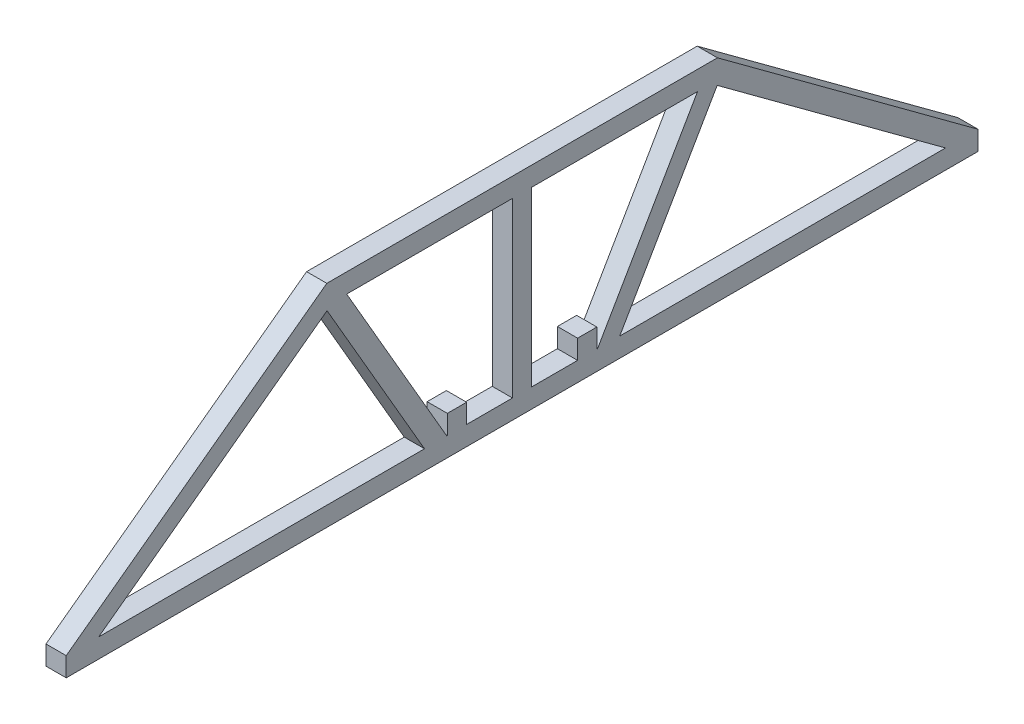
ISO-10303-21;
HEADER;
FILE_DESCRIPTION(('STEP AP214'),'2;1');
FILE_NAME('part.step','',(''),(''),'','','');
FILE_SCHEMA(('AUTOMOTIVE_DESIGN { 1 0 10303 214 1 1 1 1 }'));
ENDSEC;
DATA;
#1=APPLICATION_CONTEXT('core data for automotive mechanical design processes');
#2=APPLICATION_PROTOCOL_DEFINITION('international standard','automotive_design',2000,#1);
#3=PRODUCT_CONTEXT('',#1,'mechanical');
#4=PRODUCT('Part','Part','',(#3));
#5=PRODUCT_RELATED_PRODUCT_CATEGORY('part','',(#4));
#6=PRODUCT_DEFINITION_FORMATION('','',#4);
#7=PRODUCT_DEFINITION_CONTEXT('part definition',#1,'design');
#8=PRODUCT_DEFINITION('design','',#6,#7);
#9=PRODUCT_DEFINITION_SHAPE('','',#8);
#10=(LENGTH_UNIT() NAMED_UNIT(*) SI_UNIT(.MILLI.,.METRE.));
#11=(NAMED_UNIT(*) PLANE_ANGLE_UNIT() SI_UNIT($,.RADIAN.));
#12=(NAMED_UNIT(*) SI_UNIT($,.STERADIAN.) SOLID_ANGLE_UNIT());
#13=UNCERTAINTY_MEASURE_WITH_UNIT(LENGTH_MEASURE(1.E-05),#10,'distance_accuracy_value','');
#14=(GEOMETRIC_REPRESENTATION_CONTEXT(3) GLOBAL_UNCERTAINTY_ASSIGNED_CONTEXT((#13)) GLOBAL_UNIT_ASSIGNED_CONTEXT((#10,
#11,#12)) REPRESENTATION_CONTEXT('',''));
#15=CARTESIAN_POINT('',(0.,0.,0.));
#16=DIRECTION('',(0.,0.,1.));
#17=DIRECTION('',(1.,0.,0.));
#18=AXIS2_PLACEMENT_3D('',#15,#16,#17);
#19=CARTESIAN_POINT('',(19.525,-4.7625,268.6));
#20=DIRECTION('',(0.,-1.,0.));
#21=DIRECTION('',(0.,0.,-1.));
#22=AXIS2_PLACEMENT_3D('',#19,#20,#21);
#23=PLANE('',#22);
#24=DIRECTION('',(0.,0.,-1.));
#25=VECTOR('',#24,1.);
#26=CARTESIAN_POINT('',(19.525,-4.7625,268.6));
#27=LINE('',#26,#25);
#28=CARTESIAN_POINT('',(19.525,-4.76250000000004,3.19649980447192));
#29=VERTEX_POINT('',#28);
#30=CARTESIAN_POINT('',(19.525,-4.7625,454.003500195528));
#31=VERTEX_POINT('',#30);
#32=EDGE_CURVE('E395',#29,#31,#27,.F.);
#33=ORIENTED_EDGE('',*,*,#32,.T.);
#34=DIRECTION('',(-1.,0.,0.));
#35=VECTOR('',#34,1.);
#36=CARTESIAN_POINT('',(19.525,-4.7625,454.003500195528));
#37=LINE('',#36,#35);
#38=CARTESIAN_POINT('',(9.525,-4.7625,454.003500195528));
#39=VERTEX_POINT('',#38);
#40=EDGE_CURVE('E248',#31,#39,#37,.T.);
#41=ORIENTED_EDGE('',*,*,#40,.T.);
#42=DIRECTION('',(0.,0.,-1.));
#43=VECTOR('',#42,1.);
#44=CARTESIAN_POINT('',(9.525,-4.7625,268.6));
#45=LINE('',#44,#43);
#46=CARTESIAN_POINT('',(9.525,-4.76250000000004,3.19649980447192));
#47=VERTEX_POINT('',#46);
#48=EDGE_CURVE('E247',#47,#39,#45,.F.);
#49=ORIENTED_EDGE('',*,*,#48,.F.);
#50=DIRECTION('',(-1.,0.,0.));
#51=VECTOR('',#50,1.);
#52=CARTESIAN_POINT('',(19.525,-4.7625,3.1964998044719));
#53=LINE('',#52,#51);
#54=EDGE_CURVE('E421',#29,#47,#53,.T.);
#55=ORIENTED_EDGE('',*,*,#54,.F.);
#56=EDGE_LOOP('',(#33,#41,#49,#55));
#57=FACE_BOUND('',#56,.T.);
#58=ADVANCED_FACE('F43',(#57),#23,.T.);
#59=CARTESIAN_POINT('',(9.525,0.,0.));
#60=DIRECTION('',(-1.,0.,0.));
#61=DIRECTION('',(0.,0.,1.));
#62=AXIS2_PLACEMENT_3D('',#59,#60,#61);
#63=PLANE('',#62);
#64=DIRECTION('',(0.,0.865426285481126,-0.501036270541706));
#65=VECTOR('',#64,1.);
#66=CARTESIAN_POINT('',(9.525,-2.38618523845487,184.478407315396));
#67=LINE('',#66,#65);
#68=CARTESIAN_POINT('',(9.525,4.76250000000003,180.339694808922));
#69=VERTEX_POINT('',#68);
#70=CARTESIAN_POINT('',(9.525,88.0093147182848,132.144170498336));
#71=VERTEX_POINT('',#70);
#72=EDGE_CURVE('E333',#69,#71,#67,.T.);
#73=ORIENTED_EDGE('',*,*,#72,.F.);
#74=DIRECTION('',(0.,0.,-1.));
#75=VECTOR('',#74,1.);
#76=CARTESIAN_POINT('',(9.525,4.7625,4.7625));
#77=LINE('',#76,#75);
#78=CARTESIAN_POINT('',(9.525,4.7625,19.246154800791));
#79=VERTEX_POINT('',#78);
#80=EDGE_CURVE('E352',#79,#69,#77,.F.);
#81=ORIENTED_EDGE('',*,*,#80,.F.);
#82=DIRECTION('',(0.,-0.593470700908183,-0.804855593981647));
#83=VECTOR('',#82,1.);
#84=CARTESIAN_POINT('',(9.525,91.1668752336637,136.426404213074));
#85=LINE('',#84,#83);
#86=EDGE_CURVE('E347',#71,#79,#85,.T.);
#87=ORIENTED_EDGE('',*,*,#86,.F.);
#88=EDGE_LOOP('',(#73,#81,#87));
#89=FACE_BOUND('',#88,.T.);
#90=DIRECTION('',(0.,0.865426285481126,-0.501036270541706));
#91=VECTOR('',#90,1.);
#92=CARTESIAN_POINT('',(9.525,2.38618523845487,192.721592684604));
#93=LINE('',#92,#91);
#94=CARTESIAN_POINT('',(9.525,4.7625,191.345831506867));
#95=VERTEX_POINT('',#94);
#96=CARTESIAN_POINT('',(9.525,90.2375000000014,141.860305191077));
#97=VERTEX_POINT('',#96);
#98=EDGE_CURVE('E329',#95,#97,#93,.T.);
#99=ORIENTED_EDGE('',*,*,#98,.T.);
#100=DIRECTION('',(0.,0.,-1.));
#101=VECTOR('',#100,1.);
#102=CARTESIAN_POINT('',(9.525,90.2375000000021,228.599999999999));
#103=LINE('',#102,#101);
#104=CARTESIAN_POINT('',(9.525,90.2375000000021,223.837499999999));
#105=VERTEX_POINT('',#104);
#106=EDGE_CURVE('E340',#105,#97,#103,.T.);
#107=ORIENTED_EDGE('',*,*,#106,.F.);
#108=DIRECTION('',(0.,1.,0.));
#109=VECTOR('',#108,1.);
#110=CARTESIAN_POINT('',(9.525,0.,223.8375));
#111=LINE('',#110,#109);
#112=CARTESIAN_POINT('',(9.525,4.7625,223.8375));
#113=VERTEX_POINT('',#112);
#114=EDGE_CURVE('E311',#113,#105,#111,.T.);
#115=ORIENTED_EDGE('',*,*,#114,.F.);
#116=DIRECTION('',(0.,0.,-1.));
#117=VECTOR('',#116,1.);
#118=CARTESIAN_POINT('',(9.525,4.7625,188.6));
#119=LINE('',#118,#117);
#120=CARTESIAN_POINT('',(9.525,4.7625,201.159706485816));
#121=VERTEX_POINT('',#120);
#122=EDGE_CURVE('E324',#121,#113,#119,.F.);
#123=ORIENTED_EDGE('',*,*,#122,.F.);
#124=DIRECTION('',(0.,-1.,0.));
#125=VECTOR('',#124,1.);
#126=CARTESIAN_POINT('',(9.525,0.,201.159706485816));
#127=LINE('',#126,#125);
#128=CARTESIAN_POINT('',(9.525,14.2875,201.159706485816));
#129=VERTEX_POINT('',#128);
#130=EDGE_CURVE('E58',#129,#121,#127,.T.);
#131=ORIENTED_EDGE('',*,*,#130,.F.);
#132=DIRECTION('',(0.,0.,1.));
#133=VECTOR('',#132,1.);
#134=CARTESIAN_POINT('',(9.525,14.2875,0.));
#135=LINE('',#134,#133);
#136=CARTESIAN_POINT('',(9.525,14.2875,191.634706485816));
#137=VERTEX_POINT('',#136);
#138=EDGE_CURVE('E445',#137,#129,#135,.T.);
#139=ORIENTED_EDGE('',*,*,#138,.F.);
#140=DIRECTION('',(0.,1.,0.));
#141=VECTOR('',#140,1.);
#142=CARTESIAN_POINT('',(9.525,0.,191.634706485816));
#143=LINE('',#142,#141);
#144=CARTESIAN_POINT('',(9.525,4.7625,191.634706485816));
#145=VERTEX_POINT('',#144);
#146=EDGE_CURVE('E436',#145,#137,#143,.T.);
#147=ORIENTED_EDGE('',*,*,#146,.F.);
#148=EDGE_CURVE('E321',#95,#145,#119,.F.);
#149=ORIENTED_EDGE('',*,*,#148,.F.);
#150=EDGE_LOOP('',(#99,#107,#115,#123,#131,#139,#147,#149));
#151=FACE_BOUND('',#150,.T.);
#152=DIRECTION('',(0.,0.,-1.));
#153=VECTOR('',#152,1.);
#154=CARTESIAN_POINT('',(9.525,4.7625,228.6));
#155=LINE('',#154,#153);
#156=CARTESIAN_POINT('',(9.525,4.7625,233.3625));
#157=VERTEX_POINT('',#156);
#158=CARTESIAN_POINT('',(9.525,4.7625,256.040293514184));
#159=VERTEX_POINT('',#158);
#160=EDGE_CURVE('E299',#157,#159,#155,.F.);
#161=ORIENTED_EDGE('',*,*,#160,.F.);
#162=DIRECTION('',(0.,1.,0.));
#163=VECTOR('',#162,1.);
#164=CARTESIAN_POINT('',(9.525,0.,233.3625));
#165=LINE('',#164,#163);
#166=CARTESIAN_POINT('',(9.525,90.2375000000022,233.362499999999));
#167=VERTEX_POINT('',#166);
#168=EDGE_CURVE('E307',#157,#167,#165,.T.);
#169=ORIENTED_EDGE('',*,*,#168,.T.);
#170=DIRECTION('',(0.,0.,-1.));
#171=VECTOR('',#170,1.);
#172=CARTESIAN_POINT('',(9.525,90.237500000003,323.599999999999));
#173=LINE('',#172,#171);
#174=CARTESIAN_POINT('',(9.525,90.2375000000029,315.339694808921));
#175=VERTEX_POINT('',#174);
#176=EDGE_CURVE('E277',#175,#167,#173,.T.);
#177=ORIENTED_EDGE('',*,*,#176,.F.);
#178=DIRECTION('',(0.,0.865426285481136,0.501036270541687));
#179=VECTOR('',#178,1.);
#180=CARTESIAN_POINT('',(9.525,2.38618523845479,264.478407315396));
#181=LINE('',#180,#179);
#182=CARTESIAN_POINT('',(9.525,4.7625,265.854168493133));
#183=VERTEX_POINT('',#182);
#184=EDGE_CURVE('E289',#183,#175,#181,.T.);
#185=ORIENTED_EDGE('',*,*,#184,.F.);
#186=CARTESIAN_POINT('',(9.525,4.7625,265.565293514184));
#187=VERTEX_POINT('',#186);
#188=EDGE_CURVE('E302',#187,#183,#155,.F.);
#189=ORIENTED_EDGE('',*,*,#188,.F.);
#190=DIRECTION('',(0.,-1.,0.));
#191=VECTOR('',#190,1.);
#192=CARTESIAN_POINT('',(9.525,0.,265.565293514184));
#193=LINE('',#192,#191);
#194=CARTESIAN_POINT('',(9.525,14.2875,265.565293514184));
#195=VERTEX_POINT('',#194);
#196=EDGE_CURVE('E66',#195,#187,#193,.T.);
#197=ORIENTED_EDGE('',*,*,#196,.F.);
#198=DIRECTION('',(0.,0.,1.));
#199=VECTOR('',#198,1.);
#200=CARTESIAN_POINT('',(9.525,14.2875,0.));
#201=LINE('',#200,#199);
#202=CARTESIAN_POINT('',(9.525,14.2875,256.040293514184));
#203=VERTEX_POINT('',#202);
#204=EDGE_CURVE('E470',#203,#195,#201,.T.);
#205=ORIENTED_EDGE('',*,*,#204,.F.);
#206=DIRECTION('',(0.,1.,0.));
#207=VECTOR('',#206,1.);
#208=CARTESIAN_POINT('',(9.525,0.,256.040293514184));
#209=LINE('',#208,#207);
#210=EDGE_CURVE('E458',#159,#203,#209,.T.);
#211=ORIENTED_EDGE('',*,*,#210,.F.);
#212=EDGE_LOOP('',(#161,#169,#177,#185,#189,#197,#205,#211));
#213=FACE_BOUND('',#212,.T.);
#214=DIRECTION('',(0.,0.865426285481136,0.501036270541687));
#215=VECTOR('',#214,1.);
#216=CARTESIAN_POINT('',(9.525,-2.38618523845479,272.721592684604));
#217=LINE('',#216,#215);
#218=CARTESIAN_POINT('',(9.525,4.7625,276.860305191078));
#219=VERTEX_POINT('',#218);
#220=CARTESIAN_POINT('',(9.525,88.0093147182864,325.055829501662));
#221=VERTEX_POINT('',#220);
#222=EDGE_CURVE('E286',#219,#221,#217,.T.);
#223=ORIENTED_EDGE('',*,*,#222,.T.);
#224=DIRECTION('',(0.,0.593470700908185,-0.804855593981646));
#225=VECTOR('',#224,1.);
#226=CARTESIAN_POINT('',(9.525,-3.83312476633759,449.611095786925));
#227=LINE('',#226,#225);
#228=CARTESIAN_POINT('',(9.525,4.7625,437.953845199209));
#229=VERTEX_POINT('',#228);
#230=EDGE_CURVE('E254',#229,#221,#227,.T.);
#231=ORIENTED_EDGE('',*,*,#230,.F.);
#232=DIRECTION('',(0.,0.,-1.));
#233=VECTOR('',#232,1.);
#234=CARTESIAN_POINT('',(9.525,4.7625,268.6));
#235=LINE('',#234,#233);
#236=EDGE_CURVE('E256',#219,#229,#235,.F.);
#237=ORIENTED_EDGE('',*,*,#236,.F.);
#238=EDGE_LOOP('',(#223,#231,#237));
#239=FACE_BOUND('',#238,.T.);
#240=ORIENTED_EDGE('',*,*,#48,.T.);
#241=DIRECTION('',(0.,1.,0.));
#242=VECTOR('',#241,1.);
#243=CARTESIAN_POINT('',(9.525,0.,454.003500195528));
#244=LINE('',#243,#242);
#245=CARTESIAN_POINT('',(9.525,4.7625,454.003500195528));
#246=VERTEX_POINT('',#245);
#247=EDGE_CURVE('E229',#39,#246,#244,.T.);
#248=ORIENTED_EDGE('',*,*,#247,.T.);
#249=DIRECTION('',(0.,0.593470700908185,-0.804855593981646));
#250=VECTOR('',#249,1.);
#251=CARTESIAN_POINT('',(9.525,3.83312476633759,455.263904213075));
#252=LINE('',#251,#250);
#253=CARTESIAN_POINT('',(9.525,99.762500000003,325.166000195527));
#254=VERTEX_POINT('',#253);
#255=EDGE_CURVE('E243',#246,#254,#252,.T.);
#256=ORIENTED_EDGE('',*,*,#255,.T.);
#257=DIRECTION('',(0.,0.,-1.));
#258=VECTOR('',#257,1.);
#259=CARTESIAN_POINT('',(9.525,99.762500000003,323.599999999999));
#260=LINE('',#259,#258);
#261=CARTESIAN_POINT('',(9.525,99.762500000003,132.033999804473));
#262=VERTEX_POINT('',#261);
#263=EDGE_CURVE('E273',#254,#262,#260,.T.);
#264=ORIENTED_EDGE('',*,*,#263,.T.);
#265=DIRECTION('',(0.,-0.593470700908183,-0.804855593981647));
#266=VECTOR('',#265,1.);
#267=CARTESIAN_POINT('',(9.525,98.8331247663389,130.773595786924));
#268=LINE('',#267,#266);
#269=CARTESIAN_POINT('',(9.525,4.7625,3.19649980447192));
#270=VERTEX_POINT('',#269);
#271=EDGE_CURVE('E355',#262,#270,#268,.T.);
#272=ORIENTED_EDGE('',*,*,#271,.T.);
#273=DIRECTION('',(0.,1.,0.));
#274=VECTOR('',#273,1.);
#275=CARTESIAN_POINT('',(9.525,0.,3.19649980447192));
#276=LINE('',#275,#274);
#277=EDGE_CURVE('E424',#47,#270,#276,.T.);
#278=ORIENTED_EDGE('',*,*,#277,.F.);
#279=EDGE_LOOP('',(#240,#248,#256,#264,#272,#278));
#280=FACE_BOUND('',#279,.T.);
#281=ADVANCED_FACE('F241',(#89,#151,#213,#239,#280),#63,.T.);
#282=CARTESIAN_POINT('',(19.525,0.,0.));
#283=DIRECTION('',(-1.,0.,0.));
#284=DIRECTION('',(0.,0.,1.));
#285=AXIS2_PLACEMENT_3D('',#282,#283,#284);
#286=PLANE('',#285);
#287=DIRECTION('',(0.,0.593470700908185,-0.804855593981646));
#288=VECTOR('',#287,1.);
#289=CARTESIAN_POINT('',(19.525,-3.83312476633759,449.611095786925));
#290=LINE('',#289,#288);
#291=CARTESIAN_POINT('',(19.525,4.7625,437.953845199209));
#292=VERTEX_POINT('',#291);
#293=CARTESIAN_POINT('',(19.525,88.0093147182864,325.055829501662));
#294=VERTEX_POINT('',#293);
#295=EDGE_CURVE('E264',#292,#294,#290,.T.);
#296=ORIENTED_EDGE('',*,*,#295,.T.);
#297=DIRECTION('',(0.,0.865426285481136,0.501036270541687));
#298=VECTOR('',#297,1.);
#299=CARTESIAN_POINT('',(19.525,-2.38618523845479,272.721592684604));
#300=LINE('',#299,#298);
#301=CARTESIAN_POINT('',(19.525,4.7625,276.860305191078));
#302=VERTEX_POINT('',#301);
#303=EDGE_CURVE('E285',#302,#294,#300,.T.);
#304=ORIENTED_EDGE('',*,*,#303,.F.);
#305=DIRECTION('',(0.,0.,-1.));
#306=VECTOR('',#305,1.);
#307=CARTESIAN_POINT('',(19.525,4.7625,268.6));
#308=LINE('',#307,#306);
#309=EDGE_CURVE('E268',#302,#292,#308,.F.);
#310=ORIENTED_EDGE('',*,*,#309,.T.);
#311=EDGE_LOOP('',(#296,#304,#310));
#312=FACE_BOUND('',#311,.T.);
#313=DIRECTION('',(0.,1.,0.));
#314=VECTOR('',#313,1.);
#315=CARTESIAN_POINT('',(19.525,0.,233.3625));
#316=LINE('',#315,#314);
#317=CARTESIAN_POINT('',(19.525,4.7625,233.3625));
#318=VERTEX_POINT('',#317);
#319=CARTESIAN_POINT('',(19.525,90.2375000000022,233.362499999999));
#320=VERTEX_POINT('',#319);
#321=EDGE_CURVE('E306',#318,#320,#316,.T.);
#322=ORIENTED_EDGE('',*,*,#321,.F.);
#323=DIRECTION('',(0.,0.,-1.));
#324=VECTOR('',#323,1.);
#325=CARTESIAN_POINT('',(19.525,4.7625,228.6));
#326=LINE('',#325,#324);
#327=CARTESIAN_POINT('',(19.525,4.7625,256.040293514184));
#328=VERTEX_POINT('',#327);
#329=EDGE_CURVE('E295',#318,#328,#326,.F.);
#330=ORIENTED_EDGE('',*,*,#329,.T.);
#331=DIRECTION('',(0.,1.,0.));
#332=VECTOR('',#331,1.);
#333=CARTESIAN_POINT('',(19.525,0.,256.040293514184));
#334=LINE('',#333,#332);
#335=CARTESIAN_POINT('',(19.525,14.2875,256.040293514184));
#336=VERTEX_POINT('',#335);
#337=EDGE_CURVE('E454',#328,#336,#334,.T.);
#338=ORIENTED_EDGE('',*,*,#337,.T.);
#339=DIRECTION('',(0.,0.,1.));
#340=VECTOR('',#339,1.);
#341=CARTESIAN_POINT('',(19.525,14.2875,0.));
#342=LINE('',#341,#340);
#343=CARTESIAN_POINT('',(19.525,14.2875,265.565293514184));
#344=VERTEX_POINT('',#343);
#345=EDGE_CURVE('E459',#336,#344,#342,.T.);
#346=ORIENTED_EDGE('',*,*,#345,.T.);
#347=DIRECTION('',(0.,-1.,0.));
#348=VECTOR('',#347,1.);
#349=CARTESIAN_POINT('',(19.525,0.,265.565293514184));
#350=LINE('',#349,#348);
#351=CARTESIAN_POINT('',(19.525,4.7625,265.565293514184));
#352=VERTEX_POINT('',#351);
#353=EDGE_CURVE('E455',#344,#352,#350,.T.);
#354=ORIENTED_EDGE('',*,*,#353,.T.);
#355=CARTESIAN_POINT('',(19.525,4.7625,265.854168493133));
#356=VERTEX_POINT('',#355);
#357=EDGE_CURVE('E298',#352,#356,#326,.F.);
#358=ORIENTED_EDGE('',*,*,#357,.T.);
#359=DIRECTION('',(0.,0.865426285481136,0.501036270541687));
#360=VECTOR('',#359,1.);
#361=CARTESIAN_POINT('',(19.525,2.38618523845479,264.478407315396));
#362=LINE('',#361,#360);
#363=CARTESIAN_POINT('',(19.525,90.2375000000029,315.339694808921));
#364=VERTEX_POINT('',#363);
#365=EDGE_CURVE('E282',#356,#364,#362,.T.);
#366=ORIENTED_EDGE('',*,*,#365,.T.);
#367=DIRECTION('',(0.,0.,-1.));
#368=VECTOR('',#367,1.);
#369=CARTESIAN_POINT('',(19.525,90.237500000003,323.599999999999));
#370=LINE('',#369,#368);
#371=EDGE_CURVE('E269',#364,#320,#370,.T.);
#372=ORIENTED_EDGE('',*,*,#371,.T.);
#373=EDGE_LOOP('',(#322,#330,#338,#346,#354,#358,#366,#372));
#374=FACE_BOUND('',#373,.T.);
#375=DIRECTION('',(0.,0.,-1.));
#376=VECTOR('',#375,1.);
#377=CARTESIAN_POINT('',(19.525,90.2375000000021,228.599999999999));
#378=LINE('',#377,#376);
#379=CARTESIAN_POINT('',(19.525,90.2375000000021,223.837499999999));
#380=VERTEX_POINT('',#379);
#381=CARTESIAN_POINT('',(19.525,90.2375000000014,141.860305191077));
#382=VERTEX_POINT('',#381);
#383=EDGE_CURVE('E336',#380,#382,#378,.T.);
#384=ORIENTED_EDGE('',*,*,#383,.T.);
#385=DIRECTION('',(0.,0.865426285481126,-0.501036270541706));
#386=VECTOR('',#385,1.);
#387=CARTESIAN_POINT('',(19.525,2.38618523845487,192.721592684604));
#388=LINE('',#387,#386);
#389=CARTESIAN_POINT('',(19.525,4.7625,191.345831506867));
#390=VERTEX_POINT('',#389);
#391=EDGE_CURVE('E328',#390,#382,#388,.T.);
#392=ORIENTED_EDGE('',*,*,#391,.F.);
#393=DIRECTION('',(0.,0.,-1.));
#394=VECTOR('',#393,1.);
#395=CARTESIAN_POINT('',(19.525,4.7625,188.6));
#396=LINE('',#395,#394);
#397=CARTESIAN_POINT('',(19.525,4.7625,191.634706485816));
#398=VERTEX_POINT('',#397);
#399=EDGE_CURVE('E317',#390,#398,#396,.F.);
#400=ORIENTED_EDGE('',*,*,#399,.T.);
#401=DIRECTION('',(0.,1.,0.));
#402=VECTOR('',#401,1.);
#403=CARTESIAN_POINT('',(19.525,0.,191.634706485816));
#404=LINE('',#403,#402);
#405=CARTESIAN_POINT('',(19.525,14.2875,191.634706485816));
#406=VERTEX_POINT('',#405);
#407=EDGE_CURVE('E423',#398,#406,#404,.T.);
#408=ORIENTED_EDGE('',*,*,#407,.T.);
#409=DIRECTION('',(0.,0.,1.));
#410=VECTOR('',#409,1.);
#411=CARTESIAN_POINT('',(19.525,14.2875,0.));
#412=LINE('',#411,#410);
#413=CARTESIAN_POINT('',(19.525,14.2875,201.159706485816));
#414=VERTEX_POINT('',#413);
#415=EDGE_CURVE('E427',#406,#414,#412,.T.);
#416=ORIENTED_EDGE('',*,*,#415,.T.);
#417=DIRECTION('',(0.,-1.,0.));
#418=VECTOR('',#417,1.);
#419=CARTESIAN_POINT('',(19.525,0.,201.159706485816));
#420=LINE('',#419,#418);
#421=CARTESIAN_POINT('',(19.525,4.7625,201.159706485816));
#422=VERTEX_POINT('',#421);
#423=EDGE_CURVE('E433',#414,#422,#420,.T.);
#424=ORIENTED_EDGE('',*,*,#423,.T.);
#425=CARTESIAN_POINT('',(19.525,4.7625,223.8375));
#426=VERTEX_POINT('',#425);
#427=EDGE_CURVE('E320',#422,#426,#396,.F.);
#428=ORIENTED_EDGE('',*,*,#427,.T.);
#429=DIRECTION('',(0.,1.,0.));
#430=VECTOR('',#429,1.);
#431=CARTESIAN_POINT('',(19.525,0.,223.8375));
#432=LINE('',#431,#430);
#433=EDGE_CURVE('E303',#426,#380,#432,.T.);
#434=ORIENTED_EDGE('',*,*,#433,.T.);
#435=EDGE_LOOP('',(#384,#392,#400,#408,#416,#424,#428,#434));
#436=FACE_BOUND('',#435,.T.);
#437=DIRECTION('',(0.,0.,-1.));
#438=VECTOR('',#437,1.);
#439=CARTESIAN_POINT('',(19.525,4.7625,4.7625));
#440=LINE('',#439,#438);
#441=CARTESIAN_POINT('',(19.525,4.7625,19.246154800791));
#442=VERTEX_POINT('',#441);
#443=CARTESIAN_POINT('',(19.525,4.76250000000003,180.339694808922));
#444=VERTEX_POINT('',#443);
#445=EDGE_CURVE('E343',#442,#444,#440,.F.);
#446=ORIENTED_EDGE('',*,*,#445,.T.);
#447=DIRECTION('',(0.,0.865426285481126,-0.501036270541706));
#448=VECTOR('',#447,1.);
#449=CARTESIAN_POINT('',(19.525,-2.38618523845487,184.478407315396));
#450=LINE('',#449,#448);
#451=CARTESIAN_POINT('',(19.525,88.0093147182848,132.144170498336));
#452=VERTEX_POINT('',#451);
#453=EDGE_CURVE('E325',#444,#452,#450,.T.);
#454=ORIENTED_EDGE('',*,*,#453,.T.);
#455=DIRECTION('',(0.,-0.593470700908183,-0.804855593981647));
#456=VECTOR('',#455,1.);
#457=CARTESIAN_POINT('',(19.525,91.1668752336637,136.426404213074));
#458=LINE('',#457,#456);
#459=EDGE_CURVE('E350',#452,#442,#458,.T.);
#460=ORIENTED_EDGE('',*,*,#459,.T.);
#461=EDGE_LOOP('',(#446,#454,#460));
#462=FACE_BOUND('',#461,.T.);
#463=DIRECTION('',(0.,1.,0.));
#464=VECTOR('',#463,1.);
#465=CARTESIAN_POINT('',(19.525,0.,454.003500195528));
#466=LINE('',#465,#464);
#467=CARTESIAN_POINT('',(19.525,4.7625,454.003500195528));
#468=VERTEX_POINT('',#467);
#469=EDGE_CURVE('E232',#31,#468,#466,.T.);
#470=ORIENTED_EDGE('',*,*,#469,.F.);
#471=ORIENTED_EDGE('',*,*,#32,.F.);
#472=DIRECTION('',(0.,1.,0.));
#473=VECTOR('',#472,1.);
#474=CARTESIAN_POINT('',(19.525,0.,3.19649980447192));
#475=LINE('',#474,#473);
#476=CARTESIAN_POINT('',(19.525,4.7625,3.19649980447192));
#477=VERTEX_POINT('',#476);
#478=EDGE_CURVE('E429',#29,#477,#475,.T.);
#479=ORIENTED_EDGE('',*,*,#478,.T.);
#480=DIRECTION('',(0.,-0.593470700908183,-0.804855593981647));
#481=VECTOR('',#480,1.);
#482=CARTESIAN_POINT('',(19.525,98.8331247663389,130.773595786924));
#483=LINE('',#482,#481);
#484=CARTESIAN_POINT('',(19.525,99.762500000003,132.033999804473));
#485=VERTEX_POINT('',#484);
#486=EDGE_CURVE('E346',#485,#477,#483,.T.);
#487=ORIENTED_EDGE('',*,*,#486,.F.);
#488=DIRECTION('',(0.,0.,-1.));
#489=VECTOR('',#488,1.);
#490=CARTESIAN_POINT('',(19.525,99.762500000003,323.599999999999));
#491=LINE('',#490,#489);
#492=CARTESIAN_POINT('',(19.525,99.762500000003,325.166000195527));
#493=VERTEX_POINT('',#492);
#494=EDGE_CURVE('E272',#493,#485,#491,.T.);
#495=ORIENTED_EDGE('',*,*,#494,.F.);
#496=DIRECTION('',(0.,0.593470700908185,-0.804855593981646));
#497=VECTOR('',#496,1.);
#498=CARTESIAN_POINT('',(19.525,3.83312476633759,455.263904213075));
#499=LINE('',#498,#497);
#500=EDGE_CURVE('E393',#468,#493,#499,.T.);
#501=ORIENTED_EDGE('',*,*,#500,.F.);
#502=EDGE_LOOP('',(#470,#471,#479,#487,#495,#501));
#503=FACE_BOUND('',#502,.T.);
#504=ADVANCED_FACE('F401',(#312,#374,#436,#462,#503),#286,.F.);
#505=CARTESIAN_POINT('',(19.525,4.7625,188.6));
#506=DIRECTION('',(0.,-1.,0.));
#507=DIRECTION('',(0.,0.,-1.));
#508=AXIS2_PLACEMENT_3D('',#505,#506,#507);
#509=PLANE('',#508);
#510=ORIENTED_EDGE('',*,*,#148,.T.);
#511=DIRECTION('',(1.,0.,0.));
#512=VECTOR('',#511,1.);
#513=CARTESIAN_POINT('',(-6.52465499631914,4.7625,191.634706485816));
#514=LINE('',#513,#512);
#515=EDGE_CURVE('E449',#145,#398,#514,.T.);
#516=ORIENTED_EDGE('',*,*,#515,.T.);
#517=ORIENTED_EDGE('',*,*,#399,.F.);
#518=DIRECTION('',(-1.,0.,0.));
#519=VECTOR('',#518,1.);
#520=CARTESIAN_POINT('',(19.525,4.7625,191.345831506867));
#521=LINE('',#520,#519);
#522=EDGE_CURVE('E314',#390,#95,#521,.T.);
#523=ORIENTED_EDGE('',*,*,#522,.T.);
#524=EDGE_LOOP('',(#510,#516,#517,#523));
#525=FACE_BOUND('',#524,.T.);
#526=ADVANCED_FACE('F404',(#525),#509,.F.);
#527=CARTESIAN_POINT('',(19.525,4.7625,228.6));
#528=DIRECTION('',(0.,-1.,0.));
#529=DIRECTION('',(0.,0.,-1.));
#530=AXIS2_PLACEMENT_3D('',#527,#528,#529);
#531=PLANE('',#530);
#532=ORIENTED_EDGE('',*,*,#160,.T.);
#533=DIRECTION('',(1.,0.,0.));
#534=VECTOR('',#533,1.);
#535=CARTESIAN_POINT('',(-6.52465499631914,4.7625,256.040293514184));
#536=LINE('',#535,#534);
#537=EDGE_CURVE('E237',#159,#328,#536,.T.);
#538=ORIENTED_EDGE('',*,*,#537,.T.);
#539=ORIENTED_EDGE('',*,*,#329,.F.);
#540=DIRECTION('',(-1.,0.,0.));
#541=VECTOR('',#540,1.);
#542=CARTESIAN_POINT('',(19.525,4.7625,233.3625));
#543=LINE('',#542,#541);
#544=EDGE_CURVE('E292',#318,#157,#543,.T.);
#545=ORIENTED_EDGE('',*,*,#544,.T.);
#546=EDGE_LOOP('',(#532,#538,#539,#545));
#547=FACE_BOUND('',#546,.T.);
#548=ADVANCED_FACE('F529',(#547),#531,.F.);
#549=CARTESIAN_POINT('',(19.525,98.8331247663389,130.773595786924));
#550=DIRECTION('',(0.,0.804855593981647,-0.593470700908183));
#551=DIRECTION('',(0.,0.593470700908183,0.804855593981647));
#552=AXIS2_PLACEMENT_3D('',#549,#550,#551);
#553=PLANE('',#552);
#554=ORIENTED_EDGE('',*,*,#486,.T.);
#555=DIRECTION('',(1.,0.,0.));
#556=VECTOR('',#555,1.);
#557=CARTESIAN_POINT('',(-6.52465499631914,4.7625,3.19649980447192));
#558=LINE('',#557,#556);
#559=EDGE_CURVE('E236',#270,#477,#558,.T.);
#560=ORIENTED_EDGE('',*,*,#559,.F.);
#561=ORIENTED_EDGE('',*,*,#271,.F.);
#562=DIRECTION('',(1.,0.,0.));
#563=VECTOR('',#562,1.);
#564=CARTESIAN_POINT('',(-6.52465499631914,99.762500000003,132.033999804473));
#565=LINE('',#564,#563);
#566=EDGE_CURVE('E356',#262,#485,#565,.T.);
#567=ORIENTED_EDGE('',*,*,#566,.T.);
#568=EDGE_LOOP('',(#554,#560,#561,#567));
#569=FACE_BOUND('',#568,.T.);
#570=ADVANCED_FACE('F482',(#569),#553,.T.);
#571=CARTESIAN_POINT('',(19.525,4.7625,268.6));
#572=DIRECTION('',(0.,-1.,0.));
#573=DIRECTION('',(0.,0.,-1.));
#574=AXIS2_PLACEMENT_3D('',#571,#572,#573);
#575=PLANE('',#574);
#576=ORIENTED_EDGE('',*,*,#309,.F.);
#577=DIRECTION('',(-1.,0.,0.));
#578=VECTOR('',#577,1.);
#579=CARTESIAN_POINT('',(19.525,4.7625,276.860305191078));
#580=LINE('',#579,#578);
#581=EDGE_CURVE('E51',#302,#219,#580,.T.);
#582=ORIENTED_EDGE('',*,*,#581,.T.);
#583=ORIENTED_EDGE('',*,*,#236,.T.);
#584=DIRECTION('',(-1.,0.,0.));
#585=VECTOR('',#584,1.);
#586=CARTESIAN_POINT('',(19.525,4.7625,437.953845199209));
#587=LINE('',#586,#585);
#588=EDGE_CURVE('E265',#292,#229,#587,.T.);
#589=ORIENTED_EDGE('',*,*,#588,.F.);
#590=EDGE_LOOP('',(#576,#582,#583,#589));
#591=FACE_BOUND('',#590,.T.);
#592=ADVANCED_FACE('F380',(#591),#575,.F.);
#593=CARTESIAN_POINT('',(19.525,-3.83312476633759,449.611095786925));
#594=DIRECTION('',(0.,0.804855593981646,0.593470700908185));
#595=DIRECTION('',(0.,-0.593470700908185,0.804855593981646));
#596=AXIS2_PLACEMENT_3D('',#593,#594,#595);
#597=PLANE('',#596);
#598=ORIENTED_EDGE('',*,*,#230,.T.);
#599=DIRECTION('',(1.,0.,0.));
#600=VECTOR('',#599,1.);
#601=CARTESIAN_POINT('',(19.525,88.0093147182864,325.055829501662));
#602=LINE('',#601,#600);
#603=EDGE_CURVE('E11',#221,#294,#602,.T.);
#604=ORIENTED_EDGE('',*,*,#603,.T.);
#605=ORIENTED_EDGE('',*,*,#295,.F.);
#606=ORIENTED_EDGE('',*,*,#588,.T.);
#607=EDGE_LOOP('',(#598,#604,#605,#606));
#608=FACE_BOUND('',#607,.T.);
#609=ADVANCED_FACE('F389',(#608),#597,.F.);
#610=CARTESIAN_POINT('',(19.525,3.83312476633759,455.263904213075));
#611=DIRECTION('',(0.,0.804855593981646,0.593470700908185));
#612=DIRECTION('',(0.,-0.593470700908185,0.804855593981646));
#613=AXIS2_PLACEMENT_3D('',#610,#611,#612);
#614=PLANE('',#613);
#615=DIRECTION('',(1.,0.,0.));
#616=VECTOR('',#615,1.);
#617=CARTESIAN_POINT('',(-6.52465499631914,4.7625,454.003500195528));
#618=LINE('',#617,#616);
#619=EDGE_CURVE('E226',#246,#468,#618,.T.);
#620=ORIENTED_EDGE('',*,*,#619,.T.);
#621=ORIENTED_EDGE('',*,*,#500,.T.);
#622=DIRECTION('',(1.,0.,0.));
#623=VECTOR('',#622,1.);
#624=CARTESIAN_POINT('',(-6.52465499631914,99.762500000003,325.166000195527));
#625=LINE('',#624,#623);
#626=EDGE_CURVE('E253',#254,#493,#625,.T.);
#627=ORIENTED_EDGE('',*,*,#626,.F.);
#628=ORIENTED_EDGE('',*,*,#255,.F.);
#629=EDGE_LOOP('',(#620,#621,#627,#628));
#630=FACE_BOUND('',#629,.T.);
#631=ADVANCED_FACE('F251',(#630),#614,.T.);
#632=CARTESIAN_POINT('',(19.525,-2.38618523845487,184.478407315396));
#633=DIRECTION('',(0.,0.501036270541706,0.865426285481126));
#634=DIRECTION('',(0.,-0.865426285481126,0.501036270541706));
#635=AXIS2_PLACEMENT_3D('',#632,#633,#634);
#636=PLANE('',#635);
#637=DIRECTION('',(1.,0.,0.));
#638=VECTOR('',#637,1.);
#639=CARTESIAN_POINT('',(19.525,4.7625,180.339694808922));
#640=LINE('',#639,#638);
#641=EDGE_CURVE('E364',#69,#444,#640,.T.);
#642=ORIENTED_EDGE('',*,*,#641,.F.);
#643=ORIENTED_EDGE('',*,*,#72,.T.);
#644=DIRECTION('',(-1.,0.,0.));
#645=VECTOR('',#644,1.);
#646=CARTESIAN_POINT('',(19.525,88.0093147182848,132.144170498336));
#647=LINE('',#646,#645);
#648=EDGE_CURVE('E362',#452,#71,#647,.T.);
#649=ORIENTED_EDGE('',*,*,#648,.F.);
#650=ORIENTED_EDGE('',*,*,#453,.F.);
#651=EDGE_LOOP('',(#642,#643,#649,#650));
#652=FACE_BOUND('',#651,.T.);
#653=ADVANCED_FACE('F508',(#652),#636,.F.);
#654=CARTESIAN_POINT('',(19.525,91.1668752336637,136.426404213074));
#655=DIRECTION('',(0.,0.804855593981647,-0.593470700908183));
#656=DIRECTION('',(0.,0.593470700908183,0.804855593981647));
#657=AXIS2_PLACEMENT_3D('',#654,#655,#656);
#658=PLANE('',#657);
#659=ORIENTED_EDGE('',*,*,#459,.F.);
#660=ORIENTED_EDGE('',*,*,#648,.T.);
#661=ORIENTED_EDGE('',*,*,#86,.T.);
#662=DIRECTION('',(-1.,0.,0.));
#663=VECTOR('',#662,1.);
#664=CARTESIAN_POINT('',(19.525,4.7625,19.246154800791));
#665=LINE('',#664,#663);
#666=EDGE_CURVE('E342',#442,#79,#665,.T.);
#667=ORIENTED_EDGE('',*,*,#666,.F.);
#668=EDGE_LOOP('',(#659,#660,#661,#667));
#669=FACE_BOUND('',#668,.T.);
#670=ADVANCED_FACE('F548',(#669),#658,.F.);
#671=CARTESIAN_POINT('',(19.525,4.7625,4.7625));
#672=DIRECTION('',(0.,-1.,0.));
#673=DIRECTION('',(0.,0.,-1.));
#674=AXIS2_PLACEMENT_3D('',#671,#672,#673);
#675=PLANE('',#674);
#676=ORIENTED_EDGE('',*,*,#80,.T.);
#677=ORIENTED_EDGE('',*,*,#641,.T.);
#678=ORIENTED_EDGE('',*,*,#445,.F.);
#679=ORIENTED_EDGE('',*,*,#666,.T.);
#680=EDGE_LOOP('',(#676,#677,#678,#679));
#681=FACE_BOUND('',#680,.T.);
#682=ADVANCED_FACE('F45',(#681),#675,.F.);
#683=CARTESIAN_POINT('',(19.525,2.38618523845487,192.721592684604));
#684=DIRECTION('',(0.,0.501036270541706,0.865426285481126));
#685=DIRECTION('',(0.,-0.865426285481126,0.501036270541706));
#686=AXIS2_PLACEMENT_3D('',#683,#684,#685);
#687=PLANE('',#686);
#688=ORIENTED_EDGE('',*,*,#522,.F.);
#689=ORIENTED_EDGE('',*,*,#391,.T.);
#690=DIRECTION('',(-1.,0.,0.));
#691=VECTOR('',#690,1.);
#692=CARTESIAN_POINT('',(19.525,90.2375000000014,141.860305191077));
#693=LINE('',#692,#691);
#694=EDGE_CURVE('E332',#382,#97,#693,.T.);
#695=ORIENTED_EDGE('',*,*,#694,.T.);
#696=ORIENTED_EDGE('',*,*,#98,.F.);
#697=EDGE_LOOP('',(#688,#689,#695,#696));
#698=FACE_BOUND('',#697,.T.);
#699=ADVANCED_FACE('F538',(#698),#687,.T.);
#700=CARTESIAN_POINT('',(19.525,0.,223.8375));
#701=DIRECTION('',(0.,0.,1.));
#702=DIRECTION('',(0.,-1.,0.));
#703=AXIS2_PLACEMENT_3D('',#700,#701,#702);
#704=PLANE('',#703);
#705=DIRECTION('',(1.,0.,0.));
#706=VECTOR('',#705,1.);
#707=CARTESIAN_POINT('',(19.525,4.7625,223.8375));
#708=LINE('',#707,#706);
#709=EDGE_CURVE('E370',#113,#426,#708,.T.);
#710=ORIENTED_EDGE('',*,*,#709,.F.);
#711=ORIENTED_EDGE('',*,*,#114,.T.);
#712=DIRECTION('',(-1.,0.,0.));
#713=VECTOR('',#712,1.);
#714=CARTESIAN_POINT('',(19.525,90.2375000000021,223.837499999999));
#715=LINE('',#714,#713);
#716=EDGE_CURVE('E310',#380,#105,#715,.T.);
#717=ORIENTED_EDGE('',*,*,#716,.F.);
#718=ORIENTED_EDGE('',*,*,#433,.F.);
#719=EDGE_LOOP('',(#710,#711,#717,#718));
#720=FACE_BOUND('',#719,.T.);
#721=ADVANCED_FACE('F534',(#720),#704,.F.);
#722=CARTESIAN_POINT('',(19.525,90.2375000000021,228.599999999999));
#723=DIRECTION('',(0.,1.,0.));
#724=DIRECTION('',(0.,0.,1.));
#725=AXIS2_PLACEMENT_3D('',#722,#723,#724);
#726=PLANE('',#725);
#727=ORIENTED_EDGE('',*,*,#383,.F.);
#728=ORIENTED_EDGE('',*,*,#716,.T.);
#729=ORIENTED_EDGE('',*,*,#106,.T.);
#730=ORIENTED_EDGE('',*,*,#694,.F.);
#731=EDGE_LOOP('',(#727,#728,#729,#730));
#732=FACE_BOUND('',#731,.T.);
#733=ADVANCED_FACE('F537',(#732),#726,.F.);
#734=ORIENTED_EDGE('',*,*,#427,.F.);
#735=DIRECTION('',(1.,0.,0.));
#736=VECTOR('',#735,1.);
#737=CARTESIAN_POINT('',(-6.52465499631914,4.7625,201.159706485816));
#738=LINE('',#737,#736);
#739=EDGE_CURVE('E443',#121,#422,#738,.T.);
#740=ORIENTED_EDGE('',*,*,#739,.F.);
#741=ORIENTED_EDGE('',*,*,#122,.T.);
#742=ORIENTED_EDGE('',*,*,#709,.T.);
#743=EDGE_LOOP('',(#734,#740,#741,#742));
#744=FACE_BOUND('',#743,.T.);
#745=ADVANCED_FACE('F532',(#744),#509,.F.);
#746=CARTESIAN_POINT('',(19.525,0.,233.3625));
#747=DIRECTION('',(0.,0.,1.));
#748=DIRECTION('',(0.,-1.,0.));
#749=AXIS2_PLACEMENT_3D('',#746,#747,#748);
#750=PLANE('',#749);
#751=DIRECTION('',(1.,0.,0.));
#752=VECTOR('',#751,1.);
#753=CARTESIAN_POINT('',(19.525,90.2375000000022,233.362499999999));
#754=LINE('',#753,#752);
#755=EDGE_CURVE('E276',#167,#320,#754,.T.);
#756=ORIENTED_EDGE('',*,*,#755,.F.);
#757=ORIENTED_EDGE('',*,*,#168,.F.);
#758=ORIENTED_EDGE('',*,*,#544,.F.);
#759=ORIENTED_EDGE('',*,*,#321,.T.);
#760=EDGE_LOOP('',(#756,#757,#758,#759));
#761=FACE_BOUND('',#760,.T.);
#762=ADVANCED_FACE('F517',(#761),#750,.T.);
#763=CARTESIAN_POINT('',(19.525,90.237500000003,323.599999999999));
#764=DIRECTION('',(0.,1.,0.));
#765=DIRECTION('',(0.,0.,1.));
#766=AXIS2_PLACEMENT_3D('',#763,#764,#765);
#767=PLANE('',#766);
#768=DIRECTION('',(1.,0.,0.));
#769=VECTOR('',#768,1.);
#770=CARTESIAN_POINT('',(19.525,90.2375000000029,315.339694808922));
#771=LINE('',#770,#769);
#772=EDGE_CURVE('E259',#175,#364,#771,.T.);
#773=ORIENTED_EDGE('',*,*,#772,.F.);
#774=ORIENTED_EDGE('',*,*,#176,.T.);
#775=ORIENTED_EDGE('',*,*,#755,.T.);
#776=ORIENTED_EDGE('',*,*,#371,.F.);
#777=EDGE_LOOP('',(#773,#774,#775,#776));
#778=FACE_BOUND('',#777,.T.);
#779=ADVANCED_FACE('F514',(#778),#767,.F.);
#780=CARTESIAN_POINT('',(19.525,99.762500000003,323.599999999999));
#781=DIRECTION('',(0.,1.,0.));
#782=DIRECTION('',(0.,0.,1.));
#783=AXIS2_PLACEMENT_3D('',#780,#781,#782);
#784=PLANE('',#783);
#785=ORIENTED_EDGE('',*,*,#263,.F.);
#786=ORIENTED_EDGE('',*,*,#626,.T.);
#787=ORIENTED_EDGE('',*,*,#494,.T.);
#788=ORIENTED_EDGE('',*,*,#566,.F.);
#789=EDGE_LOOP('',(#785,#786,#787,#788));
#790=FACE_BOUND('',#789,.T.);
#791=ADVANCED_FACE('F484',(#790),#784,.T.);
#792=ORIENTED_EDGE('',*,*,#357,.F.);
#793=DIRECTION('',(1.,0.,0.));
#794=VECTOR('',#793,1.);
#795=CARTESIAN_POINT('',(-6.52465499631914,4.7625,265.565293514184));
#796=LINE('',#795,#794);
#797=EDGE_CURVE('E468',#187,#352,#796,.T.);
#798=ORIENTED_EDGE('',*,*,#797,.F.);
#799=ORIENTED_EDGE('',*,*,#188,.T.);
#800=DIRECTION('',(1.,0.,0.));
#801=VECTOR('',#800,1.);
#802=CARTESIAN_POINT('',(19.525,4.7625,265.854168493133));
#803=LINE('',#802,#801);
#804=EDGE_CURVE('E280',#183,#356,#803,.T.);
#805=ORIENTED_EDGE('',*,*,#804,.T.);
#806=EDGE_LOOP('',(#792,#798,#799,#805));
#807=FACE_BOUND('',#806,.T.);
#808=ADVANCED_FACE('F513',(#807),#531,.F.);
#809=CARTESIAN_POINT('',(19.525,2.38618523845479,264.478407315396));
#810=DIRECTION('',(0.,-0.501036270541687,0.865426285481136));
#811=DIRECTION('',(0.,-0.865426285481136,-0.501036270541687));
#812=AXIS2_PLACEMENT_3D('',#809,#810,#811);
#813=PLANE('',#812);
#814=ORIENTED_EDGE('',*,*,#184,.T.);
#815=ORIENTED_EDGE('',*,*,#772,.T.);
#816=ORIENTED_EDGE('',*,*,#365,.F.);
#817=ORIENTED_EDGE('',*,*,#804,.F.);
#818=EDGE_LOOP('',(#814,#815,#816,#817));
#819=FACE_BOUND('',#818,.T.);
#820=ADVANCED_FACE('F522',(#819),#813,.F.);
#821=CARTESIAN_POINT('',(19.525,-2.38618523845479,272.721592684604));
#822=DIRECTION('',(0.,-0.501036270541687,0.865426285481136));
#823=DIRECTION('',(0.,-0.865426285481136,-0.501036270541687));
#824=AXIS2_PLACEMENT_3D('',#821,#822,#823);
#825=PLANE('',#824);
#826=ORIENTED_EDGE('',*,*,#603,.F.);
#827=ORIENTED_EDGE('',*,*,#222,.F.);
#828=ORIENTED_EDGE('',*,*,#581,.F.);
#829=ORIENTED_EDGE('',*,*,#303,.T.);
#830=EDGE_LOOP('',(#826,#827,#828,#829));
#831=FACE_BOUND('',#830,.T.);
#832=ADVANCED_FACE('F385',(#831),#825,.T.);
#833=CARTESIAN_POINT('',(-6.52465499631914,0.,256.040293514184));
#834=DIRECTION('',(0.,0.,-1.));
#835=DIRECTION('',(-1.,0.,0.));
#836=AXIS2_PLACEMENT_3D('',#833,#834,#835);
#837=PLANE('',#836);
#838=ORIENTED_EDGE('',*,*,#537,.F.);
#839=ORIENTED_EDGE('',*,*,#210,.T.);
#840=DIRECTION('',(1.,0.,0.));
#841=VECTOR('',#840,1.);
#842=CARTESIAN_POINT('',(-6.52465499631914,14.2875,256.040293514184));
#843=LINE('',#842,#841);
#844=EDGE_CURVE('E466',#203,#336,#843,.T.);
#845=ORIENTED_EDGE('',*,*,#844,.T.);
#846=ORIENTED_EDGE('',*,*,#337,.F.);
#847=EDGE_LOOP('',(#838,#839,#845,#846));
#848=FACE_BOUND('',#847,.T.);
#849=ADVANCED_FACE('F521',(#848),#837,.T.);
#850=CARTESIAN_POINT('',(-6.52465499631914,14.2875,0.));
#851=DIRECTION('',(0.,1.,0.));
#852=DIRECTION('',(0.,0.,1.));
#853=AXIS2_PLACEMENT_3D('',#850,#851,#852);
#854=PLANE('',#853);
#855=ORIENTED_EDGE('',*,*,#844,.F.);
#856=ORIENTED_EDGE('',*,*,#204,.T.);
#857=DIRECTION('',(1.,0.,0.));
#858=VECTOR('',#857,1.);
#859=CARTESIAN_POINT('',(-6.52465499631914,14.2875,265.565293514184));
#860=LINE('',#859,#858);
#861=EDGE_CURVE('E469',#195,#344,#860,.T.);
#862=ORIENTED_EDGE('',*,*,#861,.T.);
#863=ORIENTED_EDGE('',*,*,#345,.F.);
#864=EDGE_LOOP('',(#855,#856,#862,#863));
#865=FACE_BOUND('',#864,.T.);
#866=ADVANCED_FACE('F582',(#865),#854,.T.);
#867=CARTESIAN_POINT('',(-6.52465499631914,0.,265.565293514184));
#868=DIRECTION('',(0.,0.,1.));
#869=DIRECTION('',(1.,0.,0.));
#870=AXIS2_PLACEMENT_3D('',#867,#868,#869);
#871=PLANE('',#870);
#872=ORIENTED_EDGE('',*,*,#861,.F.);
#873=ORIENTED_EDGE('',*,*,#196,.T.);
#874=ORIENTED_EDGE('',*,*,#797,.T.);
#875=ORIENTED_EDGE('',*,*,#353,.F.);
#876=EDGE_LOOP('',(#872,#873,#874,#875));
#877=FACE_BOUND('',#876,.T.);
#878=ADVANCED_FACE('F576',(#877),#871,.T.);
#879=CARTESIAN_POINT('',(-6.52465499631914,0.,191.634706485816));
#880=DIRECTION('',(0.,0.,-1.));
#881=DIRECTION('',(-1.,0.,0.));
#882=AXIS2_PLACEMENT_3D('',#879,#880,#881);
#883=PLANE('',#882);
#884=ORIENTED_EDGE('',*,*,#515,.F.);
#885=ORIENTED_EDGE('',*,*,#146,.T.);
#886=DIRECTION('',(1.,0.,0.));
#887=VECTOR('',#886,1.);
#888=CARTESIAN_POINT('',(-6.52465499631914,14.2875,191.634706485816));
#889=LINE('',#888,#887);
#890=EDGE_CURVE('E441',#137,#406,#889,.T.);
#891=ORIENTED_EDGE('',*,*,#890,.T.);
#892=ORIENTED_EDGE('',*,*,#407,.F.);
#893=EDGE_LOOP('',(#884,#885,#891,#892));
#894=FACE_BOUND('',#893,.T.);
#895=ADVANCED_FACE('F589',(#894),#883,.T.);
#896=CARTESIAN_POINT('',(-6.52465499631914,14.2875,0.));
#897=DIRECTION('',(0.,1.,0.));
#898=DIRECTION('',(0.,0.,1.));
#899=AXIS2_PLACEMENT_3D('',#896,#897,#898);
#900=PLANE('',#899);
#901=ORIENTED_EDGE('',*,*,#890,.F.);
#902=ORIENTED_EDGE('',*,*,#138,.T.);
#903=DIRECTION('',(1.,0.,0.));
#904=VECTOR('',#903,1.);
#905=CARTESIAN_POINT('',(-6.52465499631914,14.2875,201.159706485816));
#906=LINE('',#905,#904);
#907=EDGE_CURVE('E444',#129,#414,#906,.T.);
#908=ORIENTED_EDGE('',*,*,#907,.T.);
#909=ORIENTED_EDGE('',*,*,#415,.F.);
#910=EDGE_LOOP('',(#901,#902,#908,#909));
#911=FACE_BOUND('',#910,.T.);
#912=ADVANCED_FACE('F495',(#911),#900,.T.);
#913=CARTESIAN_POINT('',(-6.52465499631914,0.,201.159706485816));
#914=DIRECTION('',(0.,0.,1.));
#915=DIRECTION('',(1.,0.,0.));
#916=AXIS2_PLACEMENT_3D('',#913,#914,#915);
#917=PLANE('',#916);
#918=ORIENTED_EDGE('',*,*,#907,.F.);
#919=ORIENTED_EDGE('',*,*,#130,.T.);
#920=ORIENTED_EDGE('',*,*,#739,.T.);
#921=ORIENTED_EDGE('',*,*,#423,.F.);
#922=EDGE_LOOP('',(#918,#919,#920,#921));
#923=FACE_BOUND('',#922,.T.);
#924=ADVANCED_FACE('F488',(#923),#917,.T.);
#925=CARTESIAN_POINT('',(0.,0.,3.19649980447192));
#926=DIRECTION('',(0.,0.,1.));
#927=DIRECTION('',(1.,0.,0.));
#928=AXIS2_PLACEMENT_3D('',#925,#926,#927);
#929=PLANE('',#928);
#930=ORIENTED_EDGE('',*,*,#54,.T.);
#931=ORIENTED_EDGE('',*,*,#277,.T.);
#932=ORIENTED_EDGE('',*,*,#559,.T.);
#933=ORIENTED_EDGE('',*,*,#478,.F.);
#934=EDGE_LOOP('',(#930,#931,#932,#933));
#935=FACE_BOUND('',#934,.T.);
#936=ADVANCED_FACE('F486',(#935),#929,.F.);
#937=CARTESIAN_POINT('',(0.,0.,454.003500195528));
#938=DIRECTION('',(0.,0.,1.));
#939=DIRECTION('',(1.,0.,0.));
#940=AXIS2_PLACEMENT_3D('',#937,#938,#939);
#941=PLANE('',#940);
#942=ORIENTED_EDGE('',*,*,#469,.T.);
#943=ORIENTED_EDGE('',*,*,#619,.F.);
#944=ORIENTED_EDGE('',*,*,#247,.F.);
#945=ORIENTED_EDGE('',*,*,#40,.F.);
#946=EDGE_LOOP('',(#942,#943,#944,#945));
#947=FACE_BOUND('',#946,.T.);
#948=ADVANCED_FACE('F228',(#947),#941,.T.);
#949=CLOSED_SHELL('',(#58,#281,#504,#526,#548,#570,#592,#609,#631,#653,#670,#682,#699,#721,#733,
#745,#762,#779,#791,#808,#820,#832,#849,#866,#878,#895,#912,#924,#936,#948));
#950=MANIFOLD_SOLID_BREP('B2',#949);
#951=ADVANCED_BREP_SHAPE_REPRESENTATION('',(#18,#950),#14);
#952=SHAPE_DEFINITION_REPRESENTATION(#9,#951);
ENDSEC;
END-ISO-10303-21;
